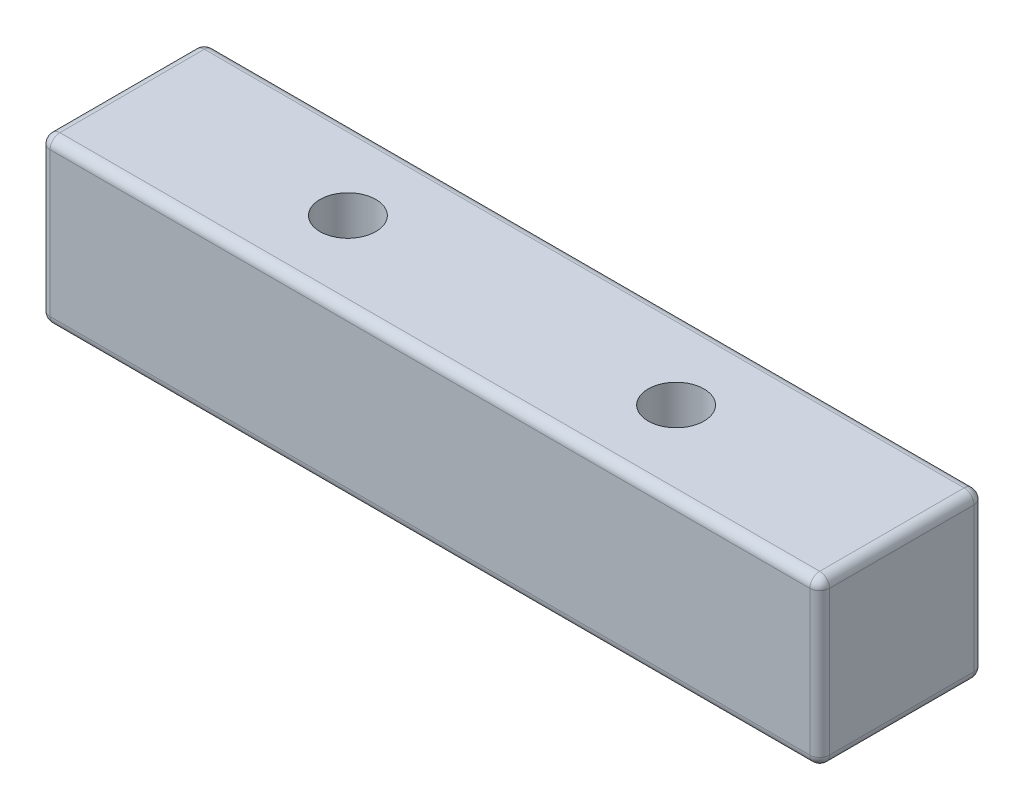
ISO-10303-21;
HEADER;
FILE_DESCRIPTION(('STEP AP214'),'2;1');
FILE_NAME('part.step','',(''),(''),'','','');
FILE_SCHEMA(('AUTOMOTIVE_DESIGN { 1 0 10303 214 1 1 1 1 }'));
ENDSEC;
DATA;
#1=APPLICATION_CONTEXT('core data for automotive mechanical design processes');
#2=APPLICATION_PROTOCOL_DEFINITION('international standard','automotive_design',2000,#1);
#3=PRODUCT_CONTEXT('',#1,'mechanical');
#4=PRODUCT('Part','Part','',(#3));
#5=PRODUCT_RELATED_PRODUCT_CATEGORY('part','',(#4));
#6=PRODUCT_DEFINITION_FORMATION('','',#4);
#7=PRODUCT_DEFINITION_CONTEXT('part definition',#1,'design');
#8=PRODUCT_DEFINITION('design','',#6,#7);
#9=PRODUCT_DEFINITION_SHAPE('','',#8);
#10=(LENGTH_UNIT() NAMED_UNIT(*) SI_UNIT(.MILLI.,.METRE.));
#11=(NAMED_UNIT(*) PLANE_ANGLE_UNIT() SI_UNIT($,.RADIAN.));
#12=(NAMED_UNIT(*) SI_UNIT($,.STERADIAN.) SOLID_ANGLE_UNIT());
#13=UNCERTAINTY_MEASURE_WITH_UNIT(LENGTH_MEASURE(1.E-05),#10,'distance_accuracy_value','');
#14=(GEOMETRIC_REPRESENTATION_CONTEXT(3) GLOBAL_UNCERTAINTY_ASSIGNED_CONTEXT((#13)) GLOBAL_UNIT_ASSIGNED_CONTEXT((#10,
#11,#12)) REPRESENTATION_CONTEXT('',''));
#15=CARTESIAN_POINT('',(0.,0.,0.));
#16=DIRECTION('',(0.,0.,1.));
#17=DIRECTION('',(1.,0.,0.));
#18=AXIS2_PLACEMENT_3D('',#15,#16,#17);
#19=CARTESIAN_POINT('',(42.8625,12.7,-6.35));
#20=DIRECTION('',(0.,-1.,0.));
#21=DIRECTION('',(0.,0.,-1.));
#22=AXIS2_PLACEMENT_3D('',#19,#20,#21);
#23=CYLINDRICAL_SURFACE('',#22,2.159);
#24=CARTESIAN_POINT('',(42.8625,12.7,-6.35));
#25=DIRECTION('',(0.,1.,0.));
#26=DIRECTION('',(0.,0.,1.));
#27=AXIS2_PLACEMENT_3D('',#24,#25,#26);
#28=CIRCLE('',#27,2.159);
#29=CARTESIAN_POINT('',(42.8625,12.7,-4.191));
#30=VERTEX_POINT('',#29);
#31=EDGE_CURVE('E153',#30,#30,#28,.T.);
#32=ORIENTED_EDGE('',*,*,#31,.T.);
#33=EDGE_LOOP('',(#32));
#34=FACE_BOUND('',#33,.T.);
#35=CARTESIAN_POINT('',(42.8625,3.81,-6.35));
#36=DIRECTION('',(0.,-1.,0.));
#37=DIRECTION('',(0.,0.,-1.));
#38=AXIS2_PLACEMENT_3D('',#35,#36,#37);
#39=CIRCLE('',#38,2.159);
#40=CARTESIAN_POINT('',(42.8625,3.81,-8.509));
#41=VERTEX_POINT('',#40);
#42=EDGE_CURVE('E283',#41,#41,#39,.T.);
#43=ORIENTED_EDGE('',*,*,#42,.T.);
#44=EDGE_LOOP('',(#43));
#45=FACE_BOUND('',#44,.T.);
#46=ADVANCED_FACE('F33',(#34,#45),#23,.F.);
#47=CARTESIAN_POINT('',(17.4625,12.7,-6.35));
#48=DIRECTION('',(0.,-1.,0.));
#49=DIRECTION('',(0.,0.,-1.));
#50=AXIS2_PLACEMENT_3D('',#47,#48,#49);
#51=CYLINDRICAL_SURFACE('',#50,2.159);
#52=CARTESIAN_POINT('',(17.4625,12.7,-6.35));
#53=DIRECTION('',(0.,1.,0.));
#54=DIRECTION('',(0.,0.,1.));
#55=AXIS2_PLACEMENT_3D('',#52,#53,#54);
#56=CIRCLE('',#55,2.159);
#57=CARTESIAN_POINT('',(17.4625,12.7,-4.191));
#58=VERTEX_POINT('',#57);
#59=EDGE_CURVE('E280',#58,#58,#56,.T.);
#60=ORIENTED_EDGE('',*,*,#59,.T.);
#61=EDGE_LOOP('',(#60));
#62=FACE_BOUND('',#61,.T.);
#63=CARTESIAN_POINT('',(17.4625,3.81,-6.35));
#64=DIRECTION('',(0.,-1.,0.));
#65=DIRECTION('',(0.,0.,-1.));
#66=AXIS2_PLACEMENT_3D('',#63,#64,#65);
#67=CIRCLE('',#66,2.159);
#68=CARTESIAN_POINT('',(17.4625,3.81,-8.509));
#69=VERTEX_POINT('',#68);
#70=EDGE_CURVE('E277',#69,#69,#67,.T.);
#71=ORIENTED_EDGE('',*,*,#70,.T.);
#72=EDGE_LOOP('',(#71));
#73=FACE_BOUND('',#72,.T.);
#74=ADVANCED_FACE('F342',(#62,#73),#51,.F.);
#75=CARTESIAN_POINT('',(0.,12.7,0.));
#76=DIRECTION('',(0.,1.,0.));
#77=DIRECTION('',(0.,0.,1.));
#78=AXIS2_PLACEMENT_3D('',#75,#76,#77);
#79=PLANE('',#78);
#80=DIRECTION('',(-1.,0.,0.));
#81=VECTOR('',#80,1.);
#82=CARTESIAN_POINT('',(0.,12.7,-11.938));
#83=LINE('',#82,#81);
#84=CARTESIAN_POINT('',(59.563,12.7,-11.938));
#85=VERTEX_POINT('',#84);
#86=CARTESIAN_POINT('',(0.762000000000001,12.7,-11.938));
#87=VERTEX_POINT('',#86);
#88=EDGE_CURVE('E158',#85,#87,#83,.T.);
#89=ORIENTED_EDGE('',*,*,#88,.T.);
#90=DIRECTION('',(0.,0.,1.));
#91=VECTOR('',#90,1.);
#92=CARTESIAN_POINT('',(0.762,12.7,0.));
#93=LINE('',#92,#91);
#94=CARTESIAN_POINT('',(0.762,12.7,-0.762));
#95=VERTEX_POINT('',#94);
#96=EDGE_CURVE('E128',#87,#95,#93,.T.);
#97=ORIENTED_EDGE('',*,*,#96,.T.);
#98=DIRECTION('',(1.,0.,0.));
#99=VECTOR('',#98,1.);
#100=CARTESIAN_POINT('',(60.325,12.7,-0.761999999999999));
#101=LINE('',#100,#99);
#102=CARTESIAN_POINT('',(59.563,12.7,-0.761999999999999));
#103=VERTEX_POINT('',#102);
#104=EDGE_CURVE('E146',#95,#103,#101,.T.);
#105=ORIENTED_EDGE('',*,*,#104,.T.);
#106=DIRECTION('',(0.,0.,-1.));
#107=VECTOR('',#106,1.);
#108=CARTESIAN_POINT('',(59.563,12.7,-12.7));
#109=LINE('',#108,#107);
#110=EDGE_CURVE('E152',#103,#85,#109,.T.);
#111=ORIENTED_EDGE('',*,*,#110,.T.);
#112=EDGE_LOOP('',(#89,#97,#105,#111));
#113=FACE_BOUND('',#112,.T.);
#114=ORIENTED_EDGE('',*,*,#31,.F.);
#115=EDGE_LOOP('',(#114));
#116=FACE_BOUND('',#115,.T.);
#117=ORIENTED_EDGE('',*,*,#59,.F.);
#118=EDGE_LOOP('',(#117));
#119=FACE_BOUND('',#118,.T.);
#120=ADVANCED_FACE('F155',(#113,#116,#119),#79,.T.);
#121=CARTESIAN_POINT('',(0.,0.,0.));
#122=DIRECTION('',(0.,1.,0.));
#123=DIRECTION('',(0.,0.,1.));
#124=AXIS2_PLACEMENT_3D('',#121,#122,#123);
#125=PLANE('',#124);
#126=DIRECTION('',(0.,0.,-1.));
#127=VECTOR('',#126,1.);
#128=CARTESIAN_POINT('',(59.563,0.,0.));
#129=LINE('',#128,#127);
#130=CARTESIAN_POINT('',(59.563,0.,-11.938));
#131=VERTEX_POINT('',#130);
#132=CARTESIAN_POINT('',(59.563,0.,-0.761999999999999));
#133=VERTEX_POINT('',#132);
#134=EDGE_CURVE('E50',#131,#133,#129,.F.);
#135=ORIENTED_EDGE('',*,*,#134,.T.);
#136=DIRECTION('',(1.,0.,0.));
#137=VECTOR('',#136,1.);
#138=CARTESIAN_POINT('',(0.,0.,-0.762));
#139=LINE('',#138,#137);
#140=CARTESIAN_POINT('',(0.762,0.,-0.762));
#141=VERTEX_POINT('',#140);
#142=EDGE_CURVE('E208',#133,#141,#139,.F.);
#143=ORIENTED_EDGE('',*,*,#142,.T.);
#144=DIRECTION('',(0.,0.,1.));
#145=VECTOR('',#144,1.);
#146=CARTESIAN_POINT('',(0.762,0.,0.));
#147=LINE('',#146,#145);
#148=CARTESIAN_POINT('',(0.762000000000001,0.,-11.938));
#149=VERTEX_POINT('',#148);
#150=EDGE_CURVE('E204',#141,#149,#147,.F.);
#151=ORIENTED_EDGE('',*,*,#150,.T.);
#152=DIRECTION('',(-1.,0.,0.));
#153=VECTOR('',#152,1.);
#154=CARTESIAN_POINT('',(0.,0.,-11.938));
#155=LINE('',#154,#153);
#156=EDGE_CURVE('E55',#149,#131,#155,.F.);
#157=ORIENTED_EDGE('',*,*,#156,.T.);
#158=EDGE_LOOP('',(#135,#143,#151,#157));
#159=FACE_BOUND('',#158,.T.);
#160=CARTESIAN_POINT('',(17.4625,0.,-6.35));
#161=DIRECTION('',(0.,1.,0.));
#162=DIRECTION('',(0.,0.,1.));
#163=AXIS2_PLACEMENT_3D('',#160,#161,#162);
#164=CIRCLE('',#163,4.318);
#165=CARTESIAN_POINT('',(17.4625,0.,-2.032));
#166=VERTEX_POINT('',#165);
#167=EDGE_CURVE('E201',#166,#166,#164,.T.);
#168=ORIENTED_EDGE('',*,*,#167,.T.);
#169=EDGE_LOOP('',(#168));
#170=FACE_BOUND('',#169,.T.);
#171=CARTESIAN_POINT('',(42.8625,0.,-6.35));
#172=DIRECTION('',(0.,1.,0.));
#173=DIRECTION('',(0.,0.,1.));
#174=AXIS2_PLACEMENT_3D('',#171,#172,#173);
#175=CIRCLE('',#174,4.31800000000001);
#176=CARTESIAN_POINT('',(42.8625,0.,-2.03199999999999));
#177=VERTEX_POINT('',#176);
#178=EDGE_CURVE('E198',#177,#177,#175,.T.);
#179=ORIENTED_EDGE('',*,*,#178,.T.);
#180=EDGE_LOOP('',(#179));
#181=FACE_BOUND('',#180,.T.);
#182=ADVANCED_FACE('F355',(#159,#170,#181),#125,.F.);
#183=CARTESIAN_POINT('',(0.,12.7,-12.7));
#184=DIRECTION('',(1.,0.,0.));
#185=DIRECTION('',(0.,0.,-1.));
#186=AXIS2_PLACEMENT_3D('',#183,#184,#185);
#187=PLANE('',#186);
#188=DIRECTION('',(0.,-1.,0.));
#189=VECTOR('',#188,1.);
#190=CARTESIAN_POINT('',(0.,12.7,-0.762000000000001));
#191=LINE('',#190,#189);
#192=CARTESIAN_POINT('',(0.,0.762000000000001,-0.762));
#193=VERTEX_POINT('',#192);
#194=CARTESIAN_POINT('',(0.,11.938,-0.762));
#195=VERTEX_POINT('',#194);
#196=EDGE_CURVE('E162',#193,#195,#191,.F.);
#197=ORIENTED_EDGE('',*,*,#196,.T.);
#198=DIRECTION('',(0.,0.,1.));
#199=VECTOR('',#198,1.);
#200=CARTESIAN_POINT('',(0.,11.938,-12.7));
#201=LINE('',#200,#199);
#202=CARTESIAN_POINT('',(0.,11.938,-11.938));
#203=VERTEX_POINT('',#202);
#204=EDGE_CURVE('E130',#195,#203,#201,.F.);
#205=ORIENTED_EDGE('',*,*,#204,.T.);
#206=DIRECTION('',(0.,-1.,0.));
#207=VECTOR('',#206,1.);
#208=CARTESIAN_POINT('',(0.,12.7,-11.938));
#209=LINE('',#208,#207);
#210=CARTESIAN_POINT('',(0.,0.762000000000001,-11.938));
#211=VERTEX_POINT('',#210);
#212=EDGE_CURVE('E168',#203,#211,#209,.T.);
#213=ORIENTED_EDGE('',*,*,#212,.T.);
#214=DIRECTION('',(0.,0.,1.));
#215=VECTOR('',#214,1.);
#216=CARTESIAN_POINT('',(0.,0.762000000000001,-12.7));
#217=LINE('',#216,#215);
#218=EDGE_CURVE('E160',#211,#193,#217,.T.);
#219=ORIENTED_EDGE('',*,*,#218,.T.);
#220=EDGE_LOOP('',(#197,#205,#213,#219));
#221=FACE_BOUND('',#220,.T.);
#222=ADVANCED_FACE('F313',(#221),#187,.F.);
#223=CARTESIAN_POINT('',(0.,12.7,0.));
#224=DIRECTION('',(0.,0.,-1.));
#225=DIRECTION('',(-1.,0.,0.));
#226=AXIS2_PLACEMENT_3D('',#223,#224,#225);
#227=PLANE('',#226);
#228=DIRECTION('',(1.,0.,0.));
#229=VECTOR('',#228,1.);
#230=CARTESIAN_POINT('',(0.,11.938,0.));
#231=LINE('',#230,#229);
#232=CARTESIAN_POINT('',(59.563,11.938,0.));
#233=VERTEX_POINT('',#232);
#234=CARTESIAN_POINT('',(0.762,11.938,0.));
#235=VERTEX_POINT('',#234);
#236=EDGE_CURVE('E193',#233,#235,#231,.F.);
#237=ORIENTED_EDGE('',*,*,#236,.T.);
#238=DIRECTION('',(0.,-1.,0.));
#239=VECTOR('',#238,1.);
#240=CARTESIAN_POINT('',(0.762,12.7,0.));
#241=LINE('',#240,#239);
#242=CARTESIAN_POINT('',(0.762,0.762000000000001,0.));
#243=VERTEX_POINT('',#242);
#244=EDGE_CURVE('E195',#235,#243,#241,.T.);
#245=ORIENTED_EDGE('',*,*,#244,.T.);
#246=DIRECTION('',(1.,0.,0.));
#247=VECTOR('',#246,1.);
#248=CARTESIAN_POINT('',(0.,0.762000000000001,0.));
#249=LINE('',#248,#247);
#250=CARTESIAN_POINT('',(59.563,0.762000000000001,0.));
#251=VERTEX_POINT('',#250);
#252=EDGE_CURVE('E189',#243,#251,#249,.T.);
#253=ORIENTED_EDGE('',*,*,#252,.T.);
#254=DIRECTION('',(0.,-1.,0.));
#255=VECTOR('',#254,1.);
#256=CARTESIAN_POINT('',(59.563,12.7,0.));
#257=LINE('',#256,#255);
#258=EDGE_CURVE('E191',#251,#233,#257,.F.);
#259=ORIENTED_EDGE('',*,*,#258,.T.);
#260=EDGE_LOOP('',(#237,#245,#253,#259));
#261=FACE_BOUND('',#260,.T.);
#262=ADVANCED_FACE('F321',(#261),#227,.F.);
#263=CARTESIAN_POINT('',(60.325,12.7,-12.7));
#264=DIRECTION('',(-1.,0.,0.));
#265=DIRECTION('',(0.,0.,1.));
#266=AXIS2_PLACEMENT_3D('',#263,#264,#265);
#267=PLANE('',#266);
#268=DIRECTION('',(0.,-1.,0.));
#269=VECTOR('',#268,1.);
#270=CARTESIAN_POINT('',(60.325,12.7,-11.938));
#271=LINE('',#270,#269);
#272=CARTESIAN_POINT('',(60.325,0.762000000000001,-11.938));
#273=VERTEX_POINT('',#272);
#274=CARTESIAN_POINT('',(60.325,11.938,-11.938));
#275=VERTEX_POINT('',#274);
#276=EDGE_CURVE('E184',#273,#275,#271,.F.);
#277=ORIENTED_EDGE('',*,*,#276,.T.);
#278=DIRECTION('',(0.,0.,-1.));
#279=VECTOR('',#278,1.);
#280=CARTESIAN_POINT('',(60.325,11.938,0.));
#281=LINE('',#280,#279);
#282=CARTESIAN_POINT('',(60.325,11.938,-0.761999999999999));
#283=VERTEX_POINT('',#282);
#284=EDGE_CURVE('E186',#275,#283,#281,.F.);
#285=ORIENTED_EDGE('',*,*,#284,.T.);
#286=DIRECTION('',(0.,-1.,0.));
#287=VECTOR('',#286,1.);
#288=CARTESIAN_POINT('',(60.325,12.7,-0.761999999999999));
#289=LINE('',#288,#287);
#290=CARTESIAN_POINT('',(60.325,0.762000000000001,-0.761999999999999));
#291=VERTEX_POINT('',#290);
#292=EDGE_CURVE('E182',#283,#291,#289,.T.);
#293=ORIENTED_EDGE('',*,*,#292,.T.);
#294=DIRECTION('',(0.,0.,-1.));
#295=VECTOR('',#294,1.);
#296=CARTESIAN_POINT('',(60.325,0.762000000000001,-12.7));
#297=LINE('',#296,#295);
#298=EDGE_CURVE('E180',#291,#273,#297,.T.);
#299=ORIENTED_EDGE('',*,*,#298,.T.);
#300=EDGE_LOOP('',(#277,#285,#293,#299));
#301=FACE_BOUND('',#300,.T.);
#302=ADVANCED_FACE('F362',(#301),#267,.F.);
#303=CARTESIAN_POINT('',(0.,12.7,-12.7));
#304=DIRECTION('',(0.,0.,1.));
#305=DIRECTION('',(1.,0.,0.));
#306=AXIS2_PLACEMENT_3D('',#303,#304,#305);
#307=PLANE('',#306);
#308=DIRECTION('',(0.,-1.,0.));
#309=VECTOR('',#308,1.);
#310=CARTESIAN_POINT('',(0.762000000000001,12.7,-12.7));
#311=LINE('',#310,#309);
#312=CARTESIAN_POINT('',(0.762000000000001,0.762000000000001,-12.7));
#313=VERTEX_POINT('',#312);
#314=CARTESIAN_POINT('',(0.762000000000001,11.938,-12.7));
#315=VERTEX_POINT('',#314);
#316=EDGE_CURVE('E175',#313,#315,#311,.F.);
#317=ORIENTED_EDGE('',*,*,#316,.T.);
#318=DIRECTION('',(-1.,0.,0.));
#319=VECTOR('',#318,1.);
#320=CARTESIAN_POINT('',(60.325,11.938,-12.7));
#321=LINE('',#320,#319);
#322=CARTESIAN_POINT('',(59.563,11.938,-12.7));
#323=VERTEX_POINT('',#322);
#324=EDGE_CURVE('E177',#315,#323,#321,.F.);
#325=ORIENTED_EDGE('',*,*,#324,.T.);
#326=DIRECTION('',(0.,-1.,0.));
#327=VECTOR('',#326,1.);
#328=CARTESIAN_POINT('',(59.563,12.7,-12.7));
#329=LINE('',#328,#327);
#330=CARTESIAN_POINT('',(59.563,0.762000000000001,-12.7));
#331=VERTEX_POINT('',#330);
#332=EDGE_CURVE('E173',#323,#331,#329,.T.);
#333=ORIENTED_EDGE('',*,*,#332,.T.);
#334=DIRECTION('',(-1.,0.,0.));
#335=VECTOR('',#334,1.);
#336=CARTESIAN_POINT('',(0.,0.762000000000001,-12.7));
#337=LINE('',#336,#335);
#338=EDGE_CURVE('E171',#331,#313,#337,.T.);
#339=ORIENTED_EDGE('',*,*,#338,.T.);
#340=EDGE_LOOP('',(#317,#325,#333,#339));
#341=FACE_BOUND('',#340,.T.);
#342=ADVANCED_FACE('F358',(#341),#307,.F.);
#343=CARTESIAN_POINT('',(17.4625,3.81,-6.35));
#344=DIRECTION('',(0.,-1.,0.));
#345=DIRECTION('',(0.,0.,-1.));
#346=AXIS2_PLACEMENT_3D('',#343,#344,#345);
#347=CYLINDRICAL_SURFACE('',#346,3.556);
#348=CARTESIAN_POINT('',(17.4625,0.762,-6.35));
#349=DIRECTION('',(0.,1.,0.));
#350=DIRECTION('',(0.,0.,1.));
#351=AXIS2_PLACEMENT_3D('',#348,#349,#350);
#352=CIRCLE('',#351,3.556);
#353=CARTESIAN_POINT('',(17.4625,0.762,-2.794));
#354=VERTEX_POINT('',#353);
#355=EDGE_CURVE('E42',#354,#354,#352,.F.);
#356=ORIENTED_EDGE('',*,*,#355,.T.);
#357=EDGE_LOOP('',(#356));
#358=FACE_BOUND('',#357,.T.);
#359=CARTESIAN_POINT('',(17.4625,3.81,-6.35));
#360=DIRECTION('',(0.,-1.,0.));
#361=DIRECTION('',(0.,0.,-1.));
#362=AXIS2_PLACEMENT_3D('',#359,#360,#361);
#363=CIRCLE('',#362,3.556);
#364=CARTESIAN_POINT('',(17.4625,3.81,-9.906));
#365=VERTEX_POINT('',#364);
#366=EDGE_CURVE('E266',#365,#365,#363,.T.);
#367=ORIENTED_EDGE('',*,*,#366,.F.);
#368=EDGE_LOOP('',(#367));
#369=FACE_BOUND('',#368,.T.);
#370=ADVANCED_FACE('F361',(#358,#369),#347,.F.);
#371=CARTESIAN_POINT('',(17.4625,3.81,-6.35));
#372=DIRECTION('',(0.,-1.,0.));
#373=DIRECTION('',(0.,0.,-1.));
#374=AXIS2_PLACEMENT_3D('',#371,#372,#373);
#375=PLANE('',#374);
#376=ORIENTED_EDGE('',*,*,#70,.F.);
#377=EDGE_LOOP('',(#376));
#378=FACE_BOUND('',#377,.T.);
#379=ORIENTED_EDGE('',*,*,#366,.T.);
#380=EDGE_LOOP('',(#379));
#381=FACE_BOUND('',#380,.T.);
#382=ADVANCED_FACE('F559',(#378,#381),#375,.T.);
#383=CARTESIAN_POINT('',(42.8625,3.81,-6.35));
#384=DIRECTION('',(0.,-1.,0.));
#385=DIRECTION('',(0.,0.,-1.));
#386=AXIS2_PLACEMENT_3D('',#383,#384,#385);
#387=CYLINDRICAL_SURFACE('',#386,3.55600000000001);
#388=CARTESIAN_POINT('',(42.8625,0.762,-6.35));
#389=DIRECTION('',(0.,1.,0.));
#390=DIRECTION('',(0.,0.,1.));
#391=AXIS2_PLACEMENT_3D('',#388,#389,#390);
#392=CIRCLE('',#391,3.55600000000001);
#393=CARTESIAN_POINT('',(42.8625,0.762,-2.79399999999999));
#394=VERTEX_POINT('',#393);
#395=EDGE_CURVE('E11',#394,#394,#392,.F.);
#396=ORIENTED_EDGE('',*,*,#395,.T.);
#397=EDGE_LOOP('',(#396));
#398=FACE_BOUND('',#397,.T.);
#399=CARTESIAN_POINT('',(42.8625,3.81,-6.35));
#400=DIRECTION('',(0.,-1.,0.));
#401=DIRECTION('',(0.,0.,-1.));
#402=AXIS2_PLACEMENT_3D('',#399,#400,#401);
#403=CIRCLE('',#402,3.55600000000001);
#404=CARTESIAN_POINT('',(42.8625,3.81,-9.90600000000001));
#405=VERTEX_POINT('',#404);
#406=EDGE_CURVE('E272',#405,#405,#403,.T.);
#407=ORIENTED_EDGE('',*,*,#406,.F.);
#408=EDGE_LOOP('',(#407));
#409=FACE_BOUND('',#408,.T.);
#410=ADVANCED_FACE('F549',(#398,#409),#387,.F.);
#411=CARTESIAN_POINT('',(42.8625,3.81,-6.35));
#412=DIRECTION('',(0.,-1.,0.));
#413=DIRECTION('',(0.,0.,-1.));
#414=AXIS2_PLACEMENT_3D('',#411,#412,#413);
#415=PLANE('',#414);
#416=ORIENTED_EDGE('',*,*,#42,.F.);
#417=EDGE_LOOP('',(#416));
#418=FACE_BOUND('',#417,.T.);
#419=ORIENTED_EDGE('',*,*,#406,.T.);
#420=EDGE_LOOP('',(#419));
#421=FACE_BOUND('',#420,.T.);
#422=ADVANCED_FACE('F539',(#418,#421),#415,.T.);
#423=CARTESIAN_POINT('',(59.563,0.762000000000001,-12.7));
#424=DIRECTION('',(0.,0.,-1.));
#425=DIRECTION('',(-1.,0.,0.));
#426=AXIS2_PLACEMENT_3D('',#423,#424,#425);
#427=CYLINDRICAL_SURFACE('',#426,0.762);
#428=CARTESIAN_POINT('',(59.563,0.762000000000001,-11.938));
#429=DIRECTION('',(0.,0.,-1.));
#430=DIRECTION('',(-1.,0.,0.));
#431=AXIS2_PLACEMENT_3D('',#428,#429,#430);
#432=CIRCLE('',#431,0.762);
#433=EDGE_CURVE('E37',#273,#131,#432,.T.);
#434=ORIENTED_EDGE('',*,*,#433,.F.);
#435=ORIENTED_EDGE('',*,*,#298,.F.);
#436=CARTESIAN_POINT('',(59.563,0.762,-0.761999999999999));
#437=DIRECTION('',(0.,0.,1.));
#438=DIRECTION('',(1.,0.,0.));
#439=AXIS2_PLACEMENT_3D('',#436,#437,#438);
#440=CIRCLE('',#439,0.762);
#441=EDGE_CURVE('E260',#133,#291,#440,.T.);
#442=ORIENTED_EDGE('',*,*,#441,.F.);
#443=ORIENTED_EDGE('',*,*,#134,.F.);
#444=EDGE_LOOP('',(#434,#435,#442,#443));
#445=FACE_BOUND('',#444,.T.);
#446=ADVANCED_FACE('F531',(#445),#427,.T.);
#447=CARTESIAN_POINT('',(59.563,0.762,-11.938));
#448=DIRECTION('',(0.,0.,1.));
#449=DIRECTION('',(1.,0.,0.));
#450=AXIS2_PLACEMENT_3D('',#447,#448,#449);
#451=SPHERICAL_SURFACE('',#450,0.762);
#452=CARTESIAN_POINT('',(59.563,0.762000000000001,-11.938));
#453=DIRECTION('',(0.,-1.,0.));
#454=DIRECTION('',(0.,0.,-1.));
#455=AXIS2_PLACEMENT_3D('',#452,#453,#454);
#456=CIRCLE('',#455,0.762);
#457=EDGE_CURVE('E255',#273,#331,#456,.F.);
#458=ORIENTED_EDGE('',*,*,#457,.F.);
#459=ORIENTED_EDGE('',*,*,#433,.T.);
#460=CARTESIAN_POINT('',(59.563,0.762,-11.938));
#461=DIRECTION('',(1.,0.,0.));
#462=DIRECTION('',(0.,0.,-1.));
#463=AXIS2_PLACEMENT_3D('',#460,#461,#462);
#464=CIRCLE('',#463,0.762);
#465=EDGE_CURVE('E258',#331,#131,#464,.F.);
#466=ORIENTED_EDGE('',*,*,#465,.F.);
#467=EDGE_LOOP('',(#458,#459,#466));
#468=FACE_BOUND('',#467,.T.);
#469=ADVANCED_FACE('F523',(#468),#451,.T.);
#470=CARTESIAN_POINT('',(59.563,0.762,-0.761999999999999));
#471=DIRECTION('',(0.,0.,1.));
#472=DIRECTION('',(1.,0.,0.));
#473=AXIS2_PLACEMENT_3D('',#470,#471,#472);
#474=SPHERICAL_SURFACE('',#473,0.762);
#475=CARTESIAN_POINT('',(59.563,0.762000000000001,-0.761999999999999));
#476=DIRECTION('',(1.,0.,0.));
#477=DIRECTION('',(0.,0.,-1.));
#478=AXIS2_PLACEMENT_3D('',#475,#476,#477);
#479=CIRCLE('',#478,0.762);
#480=EDGE_CURVE('E249',#133,#251,#479,.F.);
#481=ORIENTED_EDGE('',*,*,#480,.F.);
#482=ORIENTED_EDGE('',*,*,#441,.T.);
#483=CARTESIAN_POINT('',(59.563,0.762000000000001,-0.761999999999999));
#484=DIRECTION('',(0.,-1.,0.));
#485=DIRECTION('',(0.,0.,-1.));
#486=AXIS2_PLACEMENT_3D('',#483,#484,#485);
#487=CIRCLE('',#486,0.762);
#488=EDGE_CURVE('E252',#251,#291,#487,.F.);
#489=ORIENTED_EDGE('',*,*,#488,.F.);
#490=EDGE_LOOP('',(#481,#482,#489));
#491=FACE_BOUND('',#490,.T.);
#492=ADVANCED_FACE('F514',(#491),#474,.T.);
#493=CARTESIAN_POINT('',(0.,0.762000000000001,-11.938));
#494=DIRECTION('',(-1.,0.,0.));
#495=DIRECTION('',(0.,0.,1.));
#496=AXIS2_PLACEMENT_3D('',#493,#494,#495);
#497=CYLINDRICAL_SURFACE('',#496,0.762);
#498=ORIENTED_EDGE('',*,*,#465,.T.);
#499=ORIENTED_EDGE('',*,*,#156,.F.);
#500=CARTESIAN_POINT('',(0.762000000000001,0.762000000000001,-11.938));
#501=DIRECTION('',(-1.,0.,0.));
#502=DIRECTION('',(0.,0.,1.));
#503=AXIS2_PLACEMENT_3D('',#500,#501,#502);
#504=CIRCLE('',#503,0.762);
#505=EDGE_CURVE('E243',#313,#149,#504,.T.);
#506=ORIENTED_EDGE('',*,*,#505,.F.);
#507=ORIENTED_EDGE('',*,*,#338,.F.);
#508=EDGE_LOOP('',(#498,#499,#506,#507));
#509=FACE_BOUND('',#508,.T.);
#510=ADVANCED_FACE('F505',(#509),#497,.T.);
#511=CARTESIAN_POINT('',(59.563,12.7,-11.938));
#512=DIRECTION('',(0.,-1.,0.));
#513=DIRECTION('',(0.,0.,-1.));
#514=AXIS2_PLACEMENT_3D('',#511,#512,#513);
#515=CYLINDRICAL_SURFACE('',#514,0.762);
#516=ORIENTED_EDGE('',*,*,#457,.T.);
#517=ORIENTED_EDGE('',*,*,#332,.F.);
#518=CARTESIAN_POINT('',(59.563,11.938,-11.938));
#519=DIRECTION('',(0.,1.,0.));
#520=DIRECTION('',(0.,0.,1.));
#521=AXIS2_PLACEMENT_3D('',#518,#519,#520);
#522=CIRCLE('',#521,0.762);
#523=EDGE_CURVE('E240',#275,#323,#522,.T.);
#524=ORIENTED_EDGE('',*,*,#523,.F.);
#525=ORIENTED_EDGE('',*,*,#276,.F.);
#526=EDGE_LOOP('',(#516,#517,#524,#525));
#527=FACE_BOUND('',#526,.T.);
#528=ADVANCED_FACE('F497',(#527),#515,.T.);
#529=CARTESIAN_POINT('',(59.563,11.938,0.));
#530=DIRECTION('',(0.,0.,1.));
#531=DIRECTION('',(1.,0.,0.));
#532=AXIS2_PLACEMENT_3D('',#529,#530,#531);
#533=CYLINDRICAL_SURFACE('',#532,0.762);
#534=CARTESIAN_POINT('',(59.563,11.938,-0.761999999999999));
#535=DIRECTION('',(0.,0.,1.));
#536=DIRECTION('',(0.,-1.,0.));
#537=AXIS2_PLACEMENT_3D('',#534,#535,#536);
#538=CIRCLE('',#537,0.762);
#539=EDGE_CURVE('E234',#283,#103,#538,.T.);
#540=ORIENTED_EDGE('',*,*,#539,.F.);
#541=ORIENTED_EDGE('',*,*,#284,.F.);
#542=CARTESIAN_POINT('',(59.563,11.938,-11.938));
#543=DIRECTION('',(0.,0.,-1.));
#544=DIRECTION('',(-1.,0.,0.));
#545=AXIS2_PLACEMENT_3D('',#542,#543,#544);
#546=CIRCLE('',#545,0.762);
#547=EDGE_CURVE('E237',#85,#275,#546,.T.);
#548=ORIENTED_EDGE('',*,*,#547,.F.);
#549=ORIENTED_EDGE('',*,*,#110,.F.);
#550=EDGE_LOOP('',(#540,#541,#548,#549));
#551=FACE_BOUND('',#550,.T.);
#552=ADVANCED_FACE('F294',(#551),#533,.T.);
#553=CARTESIAN_POINT('',(59.563,12.7,-0.761999999999999));
#554=DIRECTION('',(0.,-1.,0.));
#555=DIRECTION('',(0.,0.,-1.));
#556=AXIS2_PLACEMENT_3D('',#553,#554,#555);
#557=CYLINDRICAL_SURFACE('',#556,0.762);
#558=ORIENTED_EDGE('',*,*,#488,.T.);
#559=ORIENTED_EDGE('',*,*,#292,.F.);
#560=CARTESIAN_POINT('',(59.563,11.938,-0.761999999999999));
#561=DIRECTION('',(0.,1.,0.));
#562=DIRECTION('',(0.,0.,1.));
#563=AXIS2_PLACEMENT_3D('',#560,#561,#562);
#564=CIRCLE('',#563,0.762);
#565=EDGE_CURVE('E232',#233,#283,#564,.T.);
#566=ORIENTED_EDGE('',*,*,#565,.F.);
#567=ORIENTED_EDGE('',*,*,#258,.F.);
#568=EDGE_LOOP('',(#558,#559,#566,#567));
#569=FACE_BOUND('',#568,.T.);
#570=ADVANCED_FACE('F327',(#569),#557,.T.);
#571=CARTESIAN_POINT('',(0.,0.762000000000001,-0.762));
#572=DIRECTION('',(1.,0.,0.));
#573=DIRECTION('',(0.,0.,-1.));
#574=AXIS2_PLACEMENT_3D('',#571,#572,#573);
#575=CYLINDRICAL_SURFACE('',#574,0.762);
#576=ORIENTED_EDGE('',*,*,#480,.T.);
#577=ORIENTED_EDGE('',*,*,#252,.F.);
#578=CARTESIAN_POINT('',(0.762,0.762,-0.762));
#579=DIRECTION('',(-1.,0.,0.));
#580=DIRECTION('',(0.,0.,1.));
#581=AXIS2_PLACEMENT_3D('',#578,#579,#580);
#582=CIRCLE('',#581,0.762);
#583=EDGE_CURVE('E229',#141,#243,#582,.T.);
#584=ORIENTED_EDGE('',*,*,#583,.F.);
#585=ORIENTED_EDGE('',*,*,#142,.F.);
#586=EDGE_LOOP('',(#576,#577,#584,#585));
#587=FACE_BOUND('',#586,.T.);
#588=ADVANCED_FACE('F473',(#587),#575,.T.);
#589=CARTESIAN_POINT('',(0.762000000000001,0.762000000000001,-12.7));
#590=DIRECTION('',(0.,0.,1.));
#591=DIRECTION('',(1.,0.,0.));
#592=AXIS2_PLACEMENT_3D('',#589,#590,#591);
#593=CYLINDRICAL_SURFACE('',#592,0.762);
#594=CARTESIAN_POINT('',(0.762000000000001,0.762,-11.938));
#595=DIRECTION('',(0.,0.,-1.));
#596=DIRECTION('',(-1.,0.,0.));
#597=AXIS2_PLACEMENT_3D('',#594,#595,#596);
#598=CIRCLE('',#597,0.762);
#599=EDGE_CURVE('E246',#149,#211,#598,.T.);
#600=ORIENTED_EDGE('',*,*,#599,.F.);
#601=ORIENTED_EDGE('',*,*,#150,.F.);
#602=CARTESIAN_POINT('',(0.762,0.762000000000001,-0.762));
#603=DIRECTION('',(0.,0.,1.));
#604=DIRECTION('',(1.,0.,0.));
#605=AXIS2_PLACEMENT_3D('',#602,#603,#604);
#606=CIRCLE('',#605,0.762);
#607=EDGE_CURVE('E227',#193,#141,#606,.T.);
#608=ORIENTED_EDGE('',*,*,#607,.F.);
#609=ORIENTED_EDGE('',*,*,#218,.F.);
#610=EDGE_LOOP('',(#600,#601,#608,#609));
#611=FACE_BOUND('',#610,.T.);
#612=ADVANCED_FACE('F464',(#611),#593,.T.);
#613=CARTESIAN_POINT('',(0.762000000000001,0.762,-11.938));
#614=DIRECTION('',(0.,0.,1.));
#615=DIRECTION('',(1.,0.,0.));
#616=AXIS2_PLACEMENT_3D('',#613,#614,#615);
#617=SPHERICAL_SURFACE('',#616,0.762);
#618=ORIENTED_EDGE('',*,*,#505,.T.);
#619=ORIENTED_EDGE('',*,*,#599,.T.);
#620=CARTESIAN_POINT('',(0.762000000000001,0.762000000000001,-11.938));
#621=DIRECTION('',(0.,-1.,0.));
#622=DIRECTION('',(0.,0.,-1.));
#623=AXIS2_PLACEMENT_3D('',#620,#621,#622);
#624=CIRCLE('',#623,0.762);
#625=EDGE_CURVE('E224',#313,#211,#624,.F.);
#626=ORIENTED_EDGE('',*,*,#625,.F.);
#627=EDGE_LOOP('',(#618,#619,#626));
#628=FACE_BOUND('',#627,.T.);
#629=ADVANCED_FACE('F339',(#628),#617,.T.);
#630=CARTESIAN_POINT('',(59.563,11.938,-11.938));
#631=DIRECTION('',(0.,0.,1.));
#632=DIRECTION('',(1.,0.,0.));
#633=AXIS2_PLACEMENT_3D('',#630,#631,#632);
#634=SPHERICAL_SURFACE('',#633,0.762);
#635=ORIENTED_EDGE('',*,*,#547,.T.);
#636=ORIENTED_EDGE('',*,*,#523,.T.);
#637=CARTESIAN_POINT('',(59.563,11.938,-11.938));
#638=DIRECTION('',(1.,0.,0.));
#639=DIRECTION('',(0.,0.,-1.));
#640=AXIS2_PLACEMENT_3D('',#637,#638,#639);
#641=CIRCLE('',#640,0.762);
#642=EDGE_CURVE('E222',#85,#323,#641,.F.);
#643=ORIENTED_EDGE('',*,*,#642,.F.);
#644=EDGE_LOOP('',(#635,#636,#643));
#645=FACE_BOUND('',#644,.T.);
#646=ADVANCED_FACE('F297',(#645),#634,.T.);
#647=CARTESIAN_POINT('',(59.563,11.938,-0.761999999999999));
#648=DIRECTION('',(0.,0.,1.));
#649=DIRECTION('',(1.,0.,0.));
#650=AXIS2_PLACEMENT_3D('',#647,#648,#649);
#651=SPHERICAL_SURFACE('',#650,0.762);
#652=ORIENTED_EDGE('',*,*,#565,.T.);
#653=ORIENTED_EDGE('',*,*,#539,.T.);
#654=CARTESIAN_POINT('',(59.563,11.938,-0.761999999999999));
#655=DIRECTION('',(1.,0.,0.));
#656=DIRECTION('',(0.,0.,-1.));
#657=AXIS2_PLACEMENT_3D('',#654,#655,#656);
#658=CIRCLE('',#657,0.762);
#659=EDGE_CURVE('E149',#233,#103,#658,.F.);
#660=ORIENTED_EDGE('',*,*,#659,.F.);
#661=EDGE_LOOP('',(#652,#653,#660));
#662=FACE_BOUND('',#661,.T.);
#663=ADVANCED_FACE('F329',(#662),#651,.T.);
#664=CARTESIAN_POINT('',(0.762,0.762,-0.762));
#665=DIRECTION('',(0.,0.,1.));
#666=DIRECTION('',(1.,0.,0.));
#667=AXIS2_PLACEMENT_3D('',#664,#665,#666);
#668=SPHERICAL_SURFACE('',#667,0.762);
#669=ORIENTED_EDGE('',*,*,#607,.T.);
#670=ORIENTED_EDGE('',*,*,#583,.T.);
#671=CARTESIAN_POINT('',(0.762,0.762000000000001,-0.762));
#672=DIRECTION('',(0.,-1.,0.));
#673=DIRECTION('',(0.,0.,-1.));
#674=AXIS2_PLACEMENT_3D('',#671,#672,#673);
#675=CIRCLE('',#674,0.762);
#676=EDGE_CURVE('E219',#193,#243,#675,.F.);
#677=ORIENTED_EDGE('',*,*,#676,.F.);
#678=EDGE_LOOP('',(#669,#670,#677));
#679=FACE_BOUND('',#678,.T.);
#680=ADVANCED_FACE('F331',(#679),#668,.T.);
#681=CARTESIAN_POINT('',(0.762000000000001,12.7,-11.938));
#682=DIRECTION('',(0.,-1.,0.));
#683=DIRECTION('',(0.,0.,-1.));
#684=AXIS2_PLACEMENT_3D('',#681,#682,#683);
#685=CYLINDRICAL_SURFACE('',#684,0.762);
#686=ORIENTED_EDGE('',*,*,#625,.T.);
#687=ORIENTED_EDGE('',*,*,#212,.F.);
#688=CARTESIAN_POINT('',(0.762000000000001,11.938,-11.938));
#689=DIRECTION('',(0.,1.,0.));
#690=DIRECTION('',(0.,0.,1.));
#691=AXIS2_PLACEMENT_3D('',#688,#689,#690);
#692=CIRCLE('',#691,0.762);
#693=EDGE_CURVE('E216',#315,#203,#692,.T.);
#694=ORIENTED_EDGE('',*,*,#693,.F.);
#695=ORIENTED_EDGE('',*,*,#316,.F.);
#696=EDGE_LOOP('',(#686,#687,#694,#695));
#697=FACE_BOUND('',#696,.T.);
#698=ADVANCED_FACE('F309',(#697),#685,.T.);
#699=CARTESIAN_POINT('',(0.,11.938,-11.938));
#700=DIRECTION('',(1.,0.,0.));
#701=DIRECTION('',(0.,0.,-1.));
#702=AXIS2_PLACEMENT_3D('',#699,#700,#701);
#703=CYLINDRICAL_SURFACE('',#702,0.762);
#704=ORIENTED_EDGE('',*,*,#642,.T.);
#705=ORIENTED_EDGE('',*,*,#324,.F.);
#706=CARTESIAN_POINT('',(0.762000000000001,11.938,-11.938));
#707=DIRECTION('',(-1.,0.,0.));
#708=DIRECTION('',(0.,0.,1.));
#709=AXIS2_PLACEMENT_3D('',#706,#707,#708);
#710=CIRCLE('',#709,0.762);
#711=EDGE_CURVE('E143',#87,#315,#710,.T.);
#712=ORIENTED_EDGE('',*,*,#711,.F.);
#713=ORIENTED_EDGE('',*,*,#88,.F.);
#714=EDGE_LOOP('',(#704,#705,#712,#713));
#715=FACE_BOUND('',#714,.T.);
#716=ADVANCED_FACE('F301',(#715),#703,.T.);
#717=CARTESIAN_POINT('',(0.,11.938,-0.762));
#718=DIRECTION('',(-1.,0.,0.));
#719=DIRECTION('',(0.,0.,1.));
#720=AXIS2_PLACEMENT_3D('',#717,#718,#719);
#721=CYLINDRICAL_SURFACE('',#720,0.762);
#722=ORIENTED_EDGE('',*,*,#659,.T.);
#723=ORIENTED_EDGE('',*,*,#104,.F.);
#724=CARTESIAN_POINT('',(0.762,11.938,-0.762));
#725=DIRECTION('',(-1.,0.,0.));
#726=DIRECTION('',(0.,0.,1.));
#727=AXIS2_PLACEMENT_3D('',#724,#725,#726);
#728=CIRCLE('',#727,0.762);
#729=EDGE_CURVE('E136',#235,#95,#728,.T.);
#730=ORIENTED_EDGE('',*,*,#729,.F.);
#731=ORIENTED_EDGE('',*,*,#236,.F.);
#732=EDGE_LOOP('',(#722,#723,#730,#731));
#733=FACE_BOUND('',#732,.T.);
#734=ADVANCED_FACE('F147',(#733),#721,.T.);
#735=CARTESIAN_POINT('',(0.762,12.7,-0.762));
#736=DIRECTION('',(0.,-1.,0.));
#737=DIRECTION('',(0.,0.,-1.));
#738=AXIS2_PLACEMENT_3D('',#735,#736,#737);
#739=CYLINDRICAL_SURFACE('',#738,0.762);
#740=ORIENTED_EDGE('',*,*,#676,.T.);
#741=ORIENTED_EDGE('',*,*,#244,.F.);
#742=CARTESIAN_POINT('',(0.762,11.938,-0.762));
#743=DIRECTION('',(0.,1.,0.));
#744=DIRECTION('',(0.,0.,1.));
#745=AXIS2_PLACEMENT_3D('',#742,#743,#744);
#746=CIRCLE('',#745,0.762);
#747=EDGE_CURVE('E140',#195,#235,#746,.T.);
#748=ORIENTED_EDGE('',*,*,#747,.F.);
#749=ORIENTED_EDGE('',*,*,#196,.F.);
#750=EDGE_LOOP('',(#740,#741,#748,#749));
#751=FACE_BOUND('',#750,.T.);
#752=ADVANCED_FACE('F318',(#751),#739,.T.);
#753=CARTESIAN_POINT('',(0.762000000000001,11.938,-11.938));
#754=DIRECTION('',(0.,0.,1.));
#755=DIRECTION('',(1.,0.,0.));
#756=AXIS2_PLACEMENT_3D('',#753,#754,#755);
#757=SPHERICAL_SURFACE('',#756,0.762);
#758=ORIENTED_EDGE('',*,*,#711,.T.);
#759=ORIENTED_EDGE('',*,*,#693,.T.);
#760=CARTESIAN_POINT('',(0.762000000000001,11.938,-11.938));
#761=DIRECTION('',(0.,0.,-1.));
#762=DIRECTION('',(-1.,0.,0.));
#763=AXIS2_PLACEMENT_3D('',#760,#761,#762);
#764=CIRCLE('',#763,0.762);
#765=EDGE_CURVE('E133',#87,#203,#764,.F.);
#766=ORIENTED_EDGE('',*,*,#765,.F.);
#767=EDGE_LOOP('',(#758,#759,#766));
#768=FACE_BOUND('',#767,.T.);
#769=ADVANCED_FACE('F305',(#768),#757,.T.);
#770=CARTESIAN_POINT('',(0.762,11.938,-0.762));
#771=DIRECTION('',(0.,0.,1.));
#772=DIRECTION('',(1.,0.,0.));
#773=AXIS2_PLACEMENT_3D('',#770,#771,#772);
#774=SPHERICAL_SURFACE('',#773,0.762);
#775=ORIENTED_EDGE('',*,*,#747,.T.);
#776=ORIENTED_EDGE('',*,*,#729,.T.);
#777=CARTESIAN_POINT('',(0.762,11.938,-0.762));
#778=DIRECTION('',(0.,0.,1.));
#779=DIRECTION('',(1.,0.,0.));
#780=AXIS2_PLACEMENT_3D('',#777,#778,#779);
#781=CIRCLE('',#780,0.762);
#782=EDGE_CURVE('E124',#195,#95,#781,.F.);
#783=ORIENTED_EDGE('',*,*,#782,.F.);
#784=EDGE_LOOP('',(#775,#776,#783));
#785=FACE_BOUND('',#784,.T.);
#786=ADVANCED_FACE('F138',(#785),#774,.T.);
#787=CARTESIAN_POINT('',(0.762,11.938,0.));
#788=DIRECTION('',(0.,0.,-1.));
#789=DIRECTION('',(-1.,0.,0.));
#790=AXIS2_PLACEMENT_3D('',#787,#788,#789);
#791=CYLINDRICAL_SURFACE('',#790,0.762);
#792=ORIENTED_EDGE('',*,*,#765,.T.);
#793=ORIENTED_EDGE('',*,*,#204,.F.);
#794=ORIENTED_EDGE('',*,*,#782,.T.);
#795=ORIENTED_EDGE('',*,*,#96,.F.);
#796=EDGE_LOOP('',(#792,#793,#794,#795));
#797=FACE_BOUND('',#796,.T.);
#798=ADVANCED_FACE('F126',(#797),#791,.T.);
#799=CARTESIAN_POINT('',(17.4625,0.762,-6.35));
#800=DIRECTION('',(0.,1.,0.));
#801=DIRECTION('',(0.,0.,1.));
#802=AXIS2_PLACEMENT_3D('',#799,#800,#801);
#803=TOROIDAL_SURFACE('',#802,4.318,0.762);
#804=ORIENTED_EDGE('',*,*,#167,.F.);
#805=EDGE_LOOP('',(#804));
#806=FACE_BOUND('',#805,.T.);
#807=ORIENTED_EDGE('',*,*,#355,.F.);
#808=EDGE_LOOP('',(#807));
#809=FACE_BOUND('',#808,.T.);
#810=ADVANCED_FACE('F373',(#806,#809),#803,.T.);
#811=CARTESIAN_POINT('',(42.8625,0.762,-6.35));
#812=DIRECTION('',(0.,1.,0.));
#813=DIRECTION('',(0.,0.,1.));
#814=AXIS2_PLACEMENT_3D('',#811,#812,#813);
#815=TOROIDAL_SURFACE('',#814,4.31800000000001,0.762);
#816=ORIENTED_EDGE('',*,*,#178,.F.);
#817=EDGE_LOOP('',(#816));
#818=FACE_BOUND('',#817,.T.);
#819=ORIENTED_EDGE('',*,*,#395,.F.);
#820=EDGE_LOOP('',(#819));
#821=FACE_BOUND('',#820,.T.);
#822=ADVANCED_FACE('F35',(#818,#821),#815,.T.);
#823=CLOSED_SHELL('',(#46,#74,#120,#182,#222,#262,#302,#342,#370,#382,#410,#422,#446,#469,#492,
#510,#528,#552,#570,#588,#612,#629,#646,#663,#680,#698,#716,#734,#752,#769,#786,#798,#810,#822));
#824=MANIFOLD_SOLID_BREP('B2',#823);
#825=ADVANCED_BREP_SHAPE_REPRESENTATION('',(#18,#824),#14);
#826=SHAPE_DEFINITION_REPRESENTATION(#9,#825);
ENDSEC;
END-ISO-10303-21;
